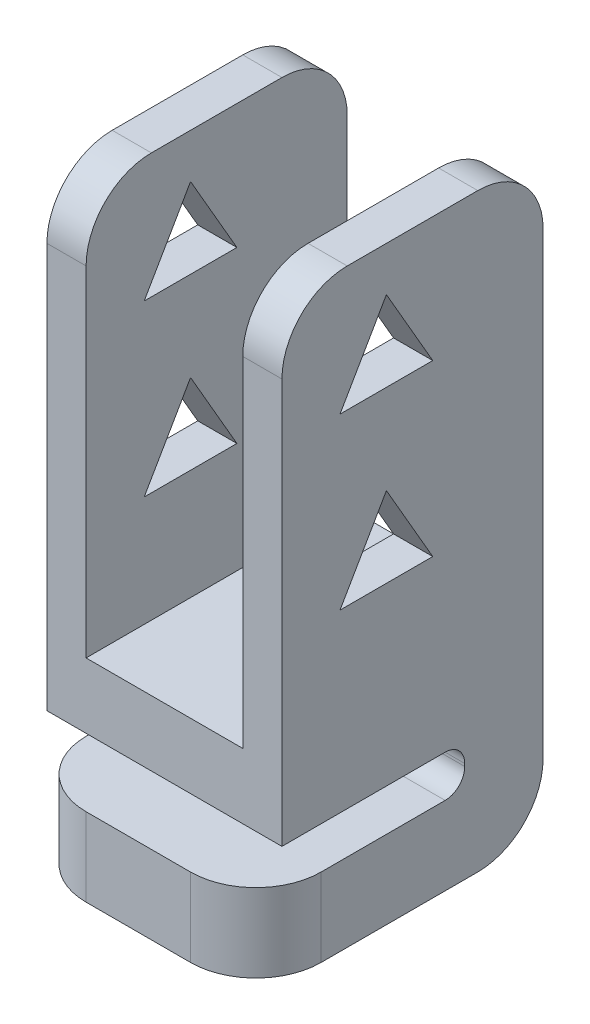
ISO-10303-21;
HEADER;
FILE_DESCRIPTION(('STEP AP214'),'2;1');
FILE_NAME('part.step','',(''),(''),'','','');
FILE_SCHEMA(('AUTOMOTIVE_DESIGN { 1 0 10303 214 1 1 1 1 }'));
ENDSEC;
DATA;
#1=APPLICATION_CONTEXT('core data for automotive mechanical design processes');
#2=APPLICATION_PROTOCOL_DEFINITION('international standard','automotive_design',2000,#1);
#3=PRODUCT_CONTEXT('',#1,'mechanical');
#4=PRODUCT('Part','Part','',(#3));
#5=PRODUCT_RELATED_PRODUCT_CATEGORY('part','',(#4));
#6=PRODUCT_DEFINITION_FORMATION('','',#4);
#7=PRODUCT_DEFINITION_CONTEXT('part definition',#1,'design');
#8=PRODUCT_DEFINITION('design','',#6,#7);
#9=PRODUCT_DEFINITION_SHAPE('','',#8);
#10=(LENGTH_UNIT() NAMED_UNIT(*) SI_UNIT(.MILLI.,.METRE.));
#11=(NAMED_UNIT(*) PLANE_ANGLE_UNIT() SI_UNIT($,.RADIAN.));
#12=(NAMED_UNIT(*) SI_UNIT($,.STERADIAN.) SOLID_ANGLE_UNIT());
#13=UNCERTAINTY_MEASURE_WITH_UNIT(LENGTH_MEASURE(1.E-05),#10,'distance_accuracy_value','');
#14=(GEOMETRIC_REPRESENTATION_CONTEXT(3) GLOBAL_UNCERTAINTY_ASSIGNED_CONTEXT((#13)) GLOBAL_UNIT_ASSIGNED_CONTEXT((#10,
#11,#12)) REPRESENTATION_CONTEXT('',''));
#15=CARTESIAN_POINT('',(0.,0.,0.));
#16=DIRECTION('',(0.,0.,1.));
#17=DIRECTION('',(1.,0.,0.));
#18=AXIS2_PLACEMENT_3D('',#15,#16,#17);
#19=CARTESIAN_POINT('',(4.5,9.,5.));
#20=DIRECTION('',(0.,-1.,0.));
#21=DIRECTION('',(0.,0.,-1.));
#22=AXIS2_PLACEMENT_3D('',#19,#20,#21);
#23=PLANE('',#22);
#24=DIRECTION('',(0.,0.,1.));
#25=VECTOR('',#24,1.);
#26=CARTESIAN_POINT('',(-4.5,9.,5.));
#27=LINE('',#26,#25);
#28=CARTESIAN_POINT('',(-4.5,9.,-2.5));
#29=VERTEX_POINT('',#28);
#30=CARTESIAN_POINT('',(-4.5,9.,2.5));
#31=VERTEX_POINT('',#30);
#32=EDGE_CURVE('E386',#29,#31,#27,.T.);
#33=ORIENTED_EDGE('',*,*,#32,.T.);
#34=DIRECTION('',(-1.,0.,0.));
#35=VECTOR('',#34,1.);
#36=CARTESIAN_POINT('',(4.5,9.,2.5));
#37=LINE('',#36,#35);
#38=CARTESIAN_POINT('',(-3.,9.,2.5));
#39=VERTEX_POINT('',#38);
#40=EDGE_CURVE('E466',#31,#39,#37,.F.);
#41=ORIENTED_EDGE('',*,*,#40,.T.);
#42=DIRECTION('',(0.,0.,1.));
#43=VECTOR('',#42,1.);
#44=CARTESIAN_POINT('',(-3.,9.,-21.6207701385947));
#45=LINE('',#44,#43);
#46=CARTESIAN_POINT('',(-3.,9.,-2.5));
#47=VERTEX_POINT('',#46);
#48=EDGE_CURVE('E357',#47,#39,#45,.T.);
#49=ORIENTED_EDGE('',*,*,#48,.F.);
#50=DIRECTION('',(-1.,0.,0.));
#51=VECTOR('',#50,1.);
#52=CARTESIAN_POINT('',(4.5,9.,-2.5));
#53=LINE('',#52,#51);
#54=EDGE_CURVE('E463',#47,#29,#53,.T.);
#55=ORIENTED_EDGE('',*,*,#54,.T.);
#56=EDGE_LOOP('',(#33,#41,#49,#55));
#57=FACE_BOUND('',#56,.T.);
#58=ADVANCED_FACE('F33',(#57),#23,.F.);
#59=CARTESIAN_POINT('',(4.5,9.,-5.));
#60=DIRECTION('',(0.,0.,1.));
#61=DIRECTION('',(0.,-1.,0.));
#62=AXIS2_PLACEMENT_3D('',#59,#60,#61);
#63=PLANE('',#62);
#64=DIRECTION('',(0.,1.,0.));
#65=VECTOR('',#64,1.);
#66=CARTESIAN_POINT('',(4.5,-13.6,-5.));
#67=LINE('',#66,#65);
#68=CARTESIAN_POINT('',(4.5,-11.1,-5.));
#69=VERTEX_POINT('',#68);
#70=CARTESIAN_POINT('',(4.5,6.5,-5.));
#71=VERTEX_POINT('',#70);
#72=EDGE_CURVE('E364',#69,#71,#67,.T.);
#73=ORIENTED_EDGE('',*,*,#72,.F.);
#74=DIRECTION('',(-1.,0.,0.));
#75=VECTOR('',#74,1.);
#76=CARTESIAN_POINT('',(4.5,-11.1,-5.));
#77=LINE('',#76,#75);
#78=CARTESIAN_POINT('',(-4.5,-11.1,-5.));
#79=VERTEX_POINT('',#78);
#80=EDGE_CURVE('E485',#69,#79,#77,.T.);
#81=ORIENTED_EDGE('',*,*,#80,.T.);
#82=DIRECTION('',(0.,1.,0.));
#83=VECTOR('',#82,1.);
#84=CARTESIAN_POINT('',(-4.5,9.,-5.));
#85=LINE('',#84,#83);
#86=CARTESIAN_POINT('',(-4.5,6.5,-5.));
#87=VERTEX_POINT('',#86);
#88=EDGE_CURVE('E363',#79,#87,#85,.T.);
#89=ORIENTED_EDGE('',*,*,#88,.T.);
#90=DIRECTION('',(-1.,0.,0.));
#91=VECTOR('',#90,1.);
#92=CARTESIAN_POINT('',(4.5,6.5,-5.));
#93=LINE('',#92,#91);
#94=CARTESIAN_POINT('',(-3.,6.5,-5.));
#95=VERTEX_POINT('',#94);
#96=EDGE_CURVE('E483',#87,#95,#93,.F.);
#97=ORIENTED_EDGE('',*,*,#96,.T.);
#98=DIRECTION('',(0.,1.,0.));
#99=VECTOR('',#98,1.);
#100=CARTESIAN_POINT('',(-3.,6.5,-5.));
#101=LINE('',#100,#99);
#102=CARTESIAN_POINT('',(-3.,-6.5,-5.));
#103=VERTEX_POINT('',#102);
#104=EDGE_CURVE('E338',#103,#95,#101,.T.);
#105=ORIENTED_EDGE('',*,*,#104,.F.);
#106=DIRECTION('',(-1.,0.,0.));
#107=VECTOR('',#106,1.);
#108=CARTESIAN_POINT('',(-3.,-6.5,-5.));
#109=LINE('',#108,#107);
#110=CARTESIAN_POINT('',(3.,-6.5,-5.));
#111=VERTEX_POINT('',#110);
#112=EDGE_CURVE('E341',#111,#103,#109,.T.);
#113=ORIENTED_EDGE('',*,*,#112,.F.);
#114=DIRECTION('',(0.,-1.,0.));
#115=VECTOR('',#114,1.);
#116=CARTESIAN_POINT('',(3.,9.,-5.));
#117=LINE('',#116,#115);
#118=CARTESIAN_POINT('',(3.,6.5,-5.));
#119=VERTEX_POINT('',#118);
#120=EDGE_CURVE('E344',#119,#111,#117,.T.);
#121=ORIENTED_EDGE('',*,*,#120,.F.);
#122=DIRECTION('',(-1.,0.,0.));
#123=VECTOR('',#122,1.);
#124=CARTESIAN_POINT('',(4.5,6.5,-5.));
#125=LINE('',#124,#123);
#126=EDGE_CURVE('E481',#119,#71,#125,.F.);
#127=ORIENTED_EDGE('',*,*,#126,.T.);
#128=EDGE_LOOP('',(#73,#81,#89,#97,#105,#113,#121,#127));
#129=FACE_BOUND('',#128,.T.);
#130=ADVANCED_FACE('F549',(#129),#63,.F.);
#131=DIRECTION('',(0.,0.,1.));
#132=VECTOR('',#131,1.);
#133=CARTESIAN_POINT('',(3.,9.,-21.6207701385947));
#134=LINE('',#133,#132);
#135=CARTESIAN_POINT('',(3.,9.,-2.5));
#136=VERTEX_POINT('',#135);
#137=CARTESIAN_POINT('',(3.,9.,2.5));
#138=VERTEX_POINT('',#137);
#139=EDGE_CURVE('E351',#136,#138,#134,.T.);
#140=ORIENTED_EDGE('',*,*,#139,.T.);
#141=DIRECTION('',(-1.,0.,0.));
#142=VECTOR('',#141,1.);
#143=CARTESIAN_POINT('',(4.5,9.,2.5));
#144=LINE('',#143,#142);
#145=CARTESIAN_POINT('',(4.5,9.,2.5));
#146=VERTEX_POINT('',#145);
#147=EDGE_CURVE('E479',#138,#146,#144,.F.);
#148=ORIENTED_EDGE('',*,*,#147,.T.);
#149=DIRECTION('',(0.,0.,1.));
#150=VECTOR('',#149,1.);
#151=CARTESIAN_POINT('',(4.5,9.,5.));
#152=LINE('',#151,#150);
#153=CARTESIAN_POINT('',(4.5,9.,-2.5));
#154=VERTEX_POINT('',#153);
#155=EDGE_CURVE('E367',#154,#146,#152,.T.);
#156=ORIENTED_EDGE('',*,*,#155,.F.);
#157=DIRECTION('',(-1.,0.,0.));
#158=VECTOR('',#157,1.);
#159=CARTESIAN_POINT('',(4.5,9.,-2.5));
#160=LINE('',#159,#158);
#161=EDGE_CURVE('E476',#154,#136,#160,.T.);
#162=ORIENTED_EDGE('',*,*,#161,.T.);
#163=EDGE_LOOP('',(#140,#148,#156,#162));
#164=FACE_BOUND('',#163,.T.);
#165=ADVANCED_FACE('F577',(#164),#23,.F.);
#166=CARTESIAN_POINT('',(4.5,9.,5.));
#167=DIRECTION('',(0.,0.,-1.));
#168=DIRECTION('',(0.,1.,0.));
#169=AXIS2_PLACEMENT_3D('',#166,#167,#168);
#170=PLANE('',#169);
#171=DIRECTION('',(0.,-1.,0.));
#172=VECTOR('',#171,1.);
#173=CARTESIAN_POINT('',(-3.,6.5,5.));
#174=LINE('',#173,#172);
#175=CARTESIAN_POINT('',(-3.,6.5,5.));
#176=VERTEX_POINT('',#175);
#177=CARTESIAN_POINT('',(-3.,-6.5,5.));
#178=VERTEX_POINT('',#177);
#179=EDGE_CURVE('E347',#176,#178,#174,.T.);
#180=ORIENTED_EDGE('',*,*,#179,.F.);
#181=DIRECTION('',(-1.,0.,0.));
#182=VECTOR('',#181,1.);
#183=CARTESIAN_POINT('',(4.5,6.5,5.));
#184=LINE('',#183,#182);
#185=CARTESIAN_POINT('',(-4.5,6.5,5.));
#186=VERTEX_POINT('',#185);
#187=EDGE_CURVE('E460',#176,#186,#184,.T.);
#188=ORIENTED_EDGE('',*,*,#187,.T.);
#189=DIRECTION('',(0.,-1.,0.));
#190=VECTOR('',#189,1.);
#191=CARTESIAN_POINT('',(-4.5,9.,5.));
#192=LINE('',#191,#190);
#193=CARTESIAN_POINT('',(-4.5,-9.,5.));
#194=VERTEX_POINT('',#193);
#195=EDGE_CURVE('E389',#186,#194,#192,.T.);
#196=ORIENTED_EDGE('',*,*,#195,.T.);
#197=DIRECTION('',(-1.,0.,0.));
#198=VECTOR('',#197,1.);
#199=CARTESIAN_POINT('',(4.5,-9.,5.));
#200=LINE('',#199,#198);
#201=CARTESIAN_POINT('',(4.5,-9.,5.));
#202=VERTEX_POINT('',#201);
#203=EDGE_CURVE('E405',#202,#194,#200,.T.);
#204=ORIENTED_EDGE('',*,*,#203,.F.);
#205=DIRECTION('',(0.,-1.,0.));
#206=VECTOR('',#205,1.);
#207=CARTESIAN_POINT('',(4.5,9.,5.));
#208=LINE('',#207,#206);
#209=CARTESIAN_POINT('',(4.5,6.5,5.));
#210=VERTEX_POINT('',#209);
#211=EDGE_CURVE('E371',#210,#202,#208,.T.);
#212=ORIENTED_EDGE('',*,*,#211,.F.);
#213=DIRECTION('',(-1.,0.,0.));
#214=VECTOR('',#213,1.);
#215=CARTESIAN_POINT('',(4.5,6.5,5.));
#216=LINE('',#215,#214);
#217=CARTESIAN_POINT('',(3.,6.5,5.));
#218=VERTEX_POINT('',#217);
#219=EDGE_CURVE('E457',#210,#218,#216,.T.);
#220=ORIENTED_EDGE('',*,*,#219,.T.);
#221=DIRECTION('',(0.,1.,0.));
#222=VECTOR('',#221,1.);
#223=CARTESIAN_POINT('',(3.,9.,5.));
#224=LINE('',#223,#222);
#225=CARTESIAN_POINT('',(3.,-6.5,5.));
#226=VERTEX_POINT('',#225);
#227=EDGE_CURVE('E337',#226,#218,#224,.T.);
#228=ORIENTED_EDGE('',*,*,#227,.F.);
#229=DIRECTION('',(1.,0.,0.));
#230=VECTOR('',#229,1.);
#231=CARTESIAN_POINT('',(-3.,-6.5,5.));
#232=LINE('',#231,#230);
#233=EDGE_CURVE('E349',#178,#226,#232,.T.);
#234=ORIENTED_EDGE('',*,*,#233,.F.);
#235=EDGE_LOOP('',(#180,#188,#196,#204,#212,#220,#228,#234));
#236=FACE_BOUND('',#235,.T.);
#237=ADVANCED_FACE('F528',(#236),#170,.F.);
#238=CARTESIAN_POINT('',(4.5,-9.,5.));
#239=DIRECTION('',(0.,1.,0.));
#240=DIRECTION('',(0.,0.,1.));
#241=AXIS2_PLACEMENT_3D('',#238,#239,#240);
#242=PLANE('',#241);
#243=DIRECTION('',(0.,0.,-1.));
#244=VECTOR('',#243,1.);
#245=CARTESIAN_POINT('',(-4.5,-9.,5.));
#246=LINE('',#245,#244);
#247=CARTESIAN_POINT('',(-4.5,-9.,-1.25));
#248=VERTEX_POINT('',#247);
#249=EDGE_CURVE('E391',#194,#248,#246,.T.);
#250=ORIENTED_EDGE('',*,*,#249,.T.);
#251=DIRECTION('',(-1.,0.,0.));
#252=VECTOR('',#251,1.);
#253=CARTESIAN_POINT('',(4.5,-9.,-1.25));
#254=LINE('',#253,#252);
#255=CARTESIAN_POINT('',(4.5,-9.,-1.25));
#256=VERTEX_POINT('',#255);
#257=EDGE_CURVE('E48',#248,#256,#254,.F.);
#258=ORIENTED_EDGE('',*,*,#257,.T.);
#259=DIRECTION('',(0.,0.,-1.));
#260=VECTOR('',#259,1.);
#261=CARTESIAN_POINT('',(4.5,-9.,5.));
#262=LINE('',#261,#260);
#263=EDGE_CURVE('E373',#202,#256,#262,.T.);
#264=ORIENTED_EDGE('',*,*,#263,.F.);
#265=ORIENTED_EDGE('',*,*,#203,.T.);
#266=EDGE_LOOP('',(#250,#258,#264,#265));
#267=FACE_BOUND('',#266,.T.);
#268=ADVANCED_FACE('F523',(#267),#242,.F.);
#269=CARTESIAN_POINT('',(4.5,-9.,-2.));
#270=DIRECTION('',(0.,0.,-1.));
#271=DIRECTION('',(0.,1.,0.));
#272=AXIS2_PLACEMENT_3D('',#269,#270,#271);
#273=PLANE('',#272);
#274=DIRECTION('',(0.,-1.,0.));
#275=VECTOR('',#274,1.);
#276=CARTESIAN_POINT('',(-4.5,-9.,-2.));
#277=LINE('',#276,#275);
#278=CARTESIAN_POINT('',(-4.5,-9.75,-2.));
#279=VERTEX_POINT('',#278);
#280=CARTESIAN_POINT('',(-4.5,-9.85,-2.));
#281=VERTEX_POINT('',#280);
#282=EDGE_CURVE('E393',#279,#281,#277,.T.);
#283=ORIENTED_EDGE('',*,*,#282,.T.);
#284=DIRECTION('',(-1.,0.,0.));
#285=VECTOR('',#284,1.);
#286=CARTESIAN_POINT('',(4.5,-9.85,-2.));
#287=LINE('',#286,#285);
#288=CARTESIAN_POINT('',(4.5,-9.85,-2.));
#289=VERTEX_POINT('',#288);
#290=EDGE_CURVE('E494',#281,#289,#287,.F.);
#291=ORIENTED_EDGE('',*,*,#290,.T.);
#292=DIRECTION('',(0.,-1.,0.));
#293=VECTOR('',#292,1.);
#294=CARTESIAN_POINT('',(4.5,-9.,-2.));
#295=LINE('',#294,#293);
#296=CARTESIAN_POINT('',(4.5,-9.75,-2.));
#297=VERTEX_POINT('',#296);
#298=EDGE_CURVE('E375',#297,#289,#295,.T.);
#299=ORIENTED_EDGE('',*,*,#298,.F.);
#300=DIRECTION('',(-1.,0.,0.));
#301=VECTOR('',#300,1.);
#302=CARTESIAN_POINT('',(-4.5,-9.75,-2.));
#303=LINE('',#302,#301);
#304=EDGE_CURVE('E491',#297,#279,#303,.T.);
#305=ORIENTED_EDGE('',*,*,#304,.T.);
#306=EDGE_LOOP('',(#283,#291,#299,#305));
#307=FACE_BOUND('',#306,.T.);
#308=ADVANCED_FACE('F517',(#307),#273,.F.);
#309=CARTESIAN_POINT('',(4.5,-10.6,-2.));
#310=DIRECTION('',(0.,-1.,0.));
#311=DIRECTION('',(0.,0.,-1.));
#312=AXIS2_PLACEMENT_3D('',#309,#310,#311);
#313=PLANE('',#312);
#314=DIRECTION('',(0.,0.,1.));
#315=VECTOR('',#314,1.);
#316=CARTESIAN_POINT('',(4.5,-10.6,-2.));
#317=LINE('',#316,#315);
#318=CARTESIAN_POINT('',(4.5,-10.6,-1.25));
#319=VERTEX_POINT('',#318);
#320=CARTESIAN_POINT('',(4.5,-10.6,3.5));
#321=VERTEX_POINT('',#320);
#322=EDGE_CURVE('E378',#319,#321,#317,.T.);
#323=ORIENTED_EDGE('',*,*,#322,.F.);
#324=DIRECTION('',(-1.,0.,0.));
#325=VECTOR('',#324,1.);
#326=CARTESIAN_POINT('',(-4.5,-10.6,-1.25));
#327=LINE('',#326,#325);
#328=CARTESIAN_POINT('',(-4.5,-10.6,-1.25));
#329=VERTEX_POINT('',#328);
#330=EDGE_CURVE('E488',#319,#329,#327,.T.);
#331=ORIENTED_EDGE('',*,*,#330,.T.);
#332=DIRECTION('',(0.,0.,1.));
#333=VECTOR('',#332,1.);
#334=CARTESIAN_POINT('',(-4.5,-10.6,-2.));
#335=LINE('',#334,#333);
#336=CARTESIAN_POINT('',(-4.5,-10.6,3.5));
#337=VERTEX_POINT('',#336);
#338=EDGE_CURVE('E396',#329,#337,#335,.T.);
#339=ORIENTED_EDGE('',*,*,#338,.T.);
#340=CARTESIAN_POINT('',(-2.,-10.6,3.5));
#341=DIRECTION('',(0.,-1.,0.));
#342=DIRECTION('',(0.,0.,-1.));
#343=AXIS2_PLACEMENT_3D('',#340,#341,#342);
#344=CIRCLE('',#343,2.5);
#345=CARTESIAN_POINT('',(-2.,-10.6,6.));
#346=VERTEX_POINT('',#345);
#347=EDGE_CURVE('E443',#337,#346,#344,.F.);
#348=ORIENTED_EDGE('',*,*,#347,.T.);
#349=DIRECTION('',(-1.,0.,0.));
#350=VECTOR('',#349,1.);
#351=CARTESIAN_POINT('',(4.5,-10.6,6.));
#352=LINE('',#351,#350);
#353=CARTESIAN_POINT('',(2.,-10.6,6.));
#354=VERTEX_POINT('',#353);
#355=EDGE_CURVE('E402',#354,#346,#352,.T.);
#356=ORIENTED_EDGE('',*,*,#355,.F.);
#357=CARTESIAN_POINT('',(2.,-10.6,3.5));
#358=DIRECTION('',(0.,-1.,0.));
#359=DIRECTION('',(0.,0.,-1.));
#360=AXIS2_PLACEMENT_3D('',#357,#358,#359);
#361=CIRCLE('',#360,2.5);
#362=EDGE_CURVE('E445',#354,#321,#361,.F.);
#363=ORIENTED_EDGE('',*,*,#362,.T.);
#364=EDGE_LOOP('',(#323,#331,#339,#348,#356,#363));
#365=FACE_BOUND('',#364,.T.);
#366=ADVANCED_FACE('F508',(#365),#313,.F.);
#367=CARTESIAN_POINT('',(4.5,-10.6,6.));
#368=DIRECTION('',(0.,0.,-1.));
#369=DIRECTION('',(0.,1.,0.));
#370=AXIS2_PLACEMENT_3D('',#367,#368,#369);
#371=PLANE('',#370);
#372=DIRECTION('',(-1.,0.,0.));
#373=VECTOR('',#372,1.);
#374=CARTESIAN_POINT('',(4.5,-13.6,6.));
#375=LINE('',#374,#373);
#376=CARTESIAN_POINT('',(2.,-13.6,6.));
#377=VERTEX_POINT('',#376);
#378=CARTESIAN_POINT('',(-2.,-13.6,6.));
#379=VERTEX_POINT('',#378);
#380=EDGE_CURVE('E383',#377,#379,#375,.T.);
#381=ORIENTED_EDGE('',*,*,#380,.F.);
#382=DIRECTION('',(0.,-1.,0.));
#383=VECTOR('',#382,1.);
#384=CARTESIAN_POINT('',(2.,-10.6,6.));
#385=LINE('',#384,#383);
#386=EDGE_CURVE('E441',#377,#354,#385,.F.);
#387=ORIENTED_EDGE('',*,*,#386,.T.);
#388=ORIENTED_EDGE('',*,*,#355,.T.);
#389=DIRECTION('',(0.,-1.,0.));
#390=VECTOR('',#389,1.);
#391=CARTESIAN_POINT('',(-2.,-13.6,6.));
#392=LINE('',#391,#390);
#393=EDGE_CURVE('E438',#346,#379,#392,.T.);
#394=ORIENTED_EDGE('',*,*,#393,.T.);
#395=EDGE_LOOP('',(#381,#387,#388,#394));
#396=FACE_BOUND('',#395,.T.);
#397=ADVANCED_FACE('F565',(#396),#371,.F.);
#398=CARTESIAN_POINT('',(4.5,-13.6,6.));
#399=DIRECTION('',(0.,1.,0.));
#400=DIRECTION('',(0.,0.,1.));
#401=AXIS2_PLACEMENT_3D('',#398,#399,#400);
#402=PLANE('',#401);
#403=DIRECTION('',(0.,0.,-1.));
#404=VECTOR('',#403,1.);
#405=CARTESIAN_POINT('',(4.5,-13.6,6.));
#406=LINE('',#405,#404);
#407=CARTESIAN_POINT('',(4.5,-13.6,3.5));
#408=VERTEX_POINT('',#407);
#409=CARTESIAN_POINT('',(4.5,-13.6,-2.5));
#410=VERTEX_POINT('',#409);
#411=EDGE_CURVE('E380',#408,#410,#406,.T.);
#412=ORIENTED_EDGE('',*,*,#411,.F.);
#413=CARTESIAN_POINT('',(2.,-13.6,3.5));
#414=DIRECTION('',(0.,1.,0.));
#415=DIRECTION('',(0.,0.,1.));
#416=AXIS2_PLACEMENT_3D('',#413,#414,#415);
#417=CIRCLE('',#416,2.5);
#418=EDGE_CURVE('E436',#408,#377,#417,.F.);
#419=ORIENTED_EDGE('',*,*,#418,.T.);
#420=ORIENTED_EDGE('',*,*,#380,.T.);
#421=CARTESIAN_POINT('',(-2.,-13.6,3.5));
#422=DIRECTION('',(0.,1.,0.));
#423=DIRECTION('',(0.,0.,1.));
#424=AXIS2_PLACEMENT_3D('',#421,#422,#423);
#425=CIRCLE('',#424,2.5);
#426=CARTESIAN_POINT('',(-4.5,-13.6,3.5));
#427=VERTEX_POINT('',#426);
#428=EDGE_CURVE('E434',#379,#427,#425,.F.);
#429=ORIENTED_EDGE('',*,*,#428,.T.);
#430=DIRECTION('',(0.,0.,-1.));
#431=VECTOR('',#430,1.);
#432=CARTESIAN_POINT('',(-4.5,-13.6,6.));
#433=LINE('',#432,#431);
#434=CARTESIAN_POINT('',(-4.5,-13.6,-2.5));
#435=VERTEX_POINT('',#434);
#436=EDGE_CURVE('E368',#427,#435,#433,.T.);
#437=ORIENTED_EDGE('',*,*,#436,.T.);
#438=DIRECTION('',(-1.,0.,0.));
#439=VECTOR('',#438,1.);
#440=CARTESIAN_POINT('',(4.5,-13.6,-2.5));
#441=LINE('',#440,#439);
#442=EDGE_CURVE('E432',#435,#410,#441,.F.);
#443=ORIENTED_EDGE('',*,*,#442,.T.);
#444=EDGE_LOOP('',(#412,#419,#420,#429,#437,#443));
#445=FACE_BOUND('',#444,.T.);
#446=ADVANCED_FACE('F558',(#445),#402,.F.);
#447=CARTESIAN_POINT('',(4.5,0.,0.));
#448=DIRECTION('',(-1.,0.,0.));
#449=DIRECTION('',(0.,0.,1.));
#450=AXIS2_PLACEMENT_3D('',#447,#448,#449);
#451=PLANE('',#450);
#452=DIRECTION('',(0.,0.866025403784439,0.5));
#453=VECTOR('',#452,1.);
#454=CARTESIAN_POINT('',(4.5,-2.275,-0.775352077758099));
#455=LINE('',#454,#453);
#456=CARTESIAN_POINT('',(4.5,-2.275,-0.775352077758099));
#457=VERTEX_POINT('',#456);
#458=CARTESIAN_POINT('',(4.5,0.8,0.999999999999999));
#459=VERTEX_POINT('',#458);
#460=EDGE_CURVE('E264',#457,#459,#455,.T.);
#461=ORIENTED_EDGE('',*,*,#460,.F.);
#462=DIRECTION('',(0.,0.,-1.));
#463=VECTOR('',#462,1.);
#464=CARTESIAN_POINT('',(4.5,-2.275,2.7753520777581));
#465=LINE('',#464,#463);
#466=CARTESIAN_POINT('',(4.5,-2.275,2.7753520777581));
#467=VERTEX_POINT('',#466);
#468=EDGE_CURVE('E269',#467,#457,#465,.T.);
#469=ORIENTED_EDGE('',*,*,#468,.F.);
#470=DIRECTION('',(0.,-0.866025403784439,0.5));
#471=VECTOR('',#470,1.);
#472=CARTESIAN_POINT('',(4.5,0.8,0.999999999999999));
#473=LINE('',#472,#471);
#474=EDGE_CURVE('E253',#459,#467,#473,.T.);
#475=ORIENTED_EDGE('',*,*,#474,.F.);
#476=EDGE_LOOP('',(#461,#469,#475));
#477=FACE_BOUND('',#476,.T.);
#478=DIRECTION('',(0.,0.866025403784439,0.5));
#479=VECTOR('',#478,1.);
#480=CARTESIAN_POINT('',(4.5,4.225,-0.775352077758099));
#481=LINE('',#480,#479);
#482=CARTESIAN_POINT('',(4.5,4.225,-0.775352077758099));
#483=VERTEX_POINT('',#482);
#484=CARTESIAN_POINT('',(4.5,7.3,1.));
#485=VERTEX_POINT('',#484);
#486=EDGE_CURVE('E302',#483,#485,#481,.T.);
#487=ORIENTED_EDGE('',*,*,#486,.F.);
#488=DIRECTION('',(0.,0.,-1.));
#489=VECTOR('',#488,1.);
#490=CARTESIAN_POINT('',(4.5,4.225,2.7753520777581));
#491=LINE('',#490,#489);
#492=CARTESIAN_POINT('',(4.5,4.225,2.7753520777581));
#493=VERTEX_POINT('',#492);
#494=EDGE_CURVE('E300',#493,#483,#491,.T.);
#495=ORIENTED_EDGE('',*,*,#494,.F.);
#496=DIRECTION('',(0.,-0.866025403784439,0.5));
#497=VECTOR('',#496,1.);
#498=CARTESIAN_POINT('',(4.5,7.3,1.));
#499=LINE('',#498,#497);
#500=EDGE_CURVE('E305',#485,#493,#499,.T.);
#501=ORIENTED_EDGE('',*,*,#500,.F.);
#502=EDGE_LOOP('',(#487,#495,#501));
#503=FACE_BOUND('',#502,.T.);
#504=ORIENTED_EDGE('',*,*,#298,.T.);
#505=CARTESIAN_POINT('',(4.5,-9.85,-1.25));
#506=DIRECTION('',(-1.,0.,0.));
#507=DIRECTION('',(0.,0.,1.));
#508=AXIS2_PLACEMENT_3D('',#505,#506,#507);
#509=CIRCLE('',#508,0.75);
#510=EDGE_CURVE('E499',#289,#319,#509,.T.);
#511=ORIENTED_EDGE('',*,*,#510,.T.);
#512=ORIENTED_EDGE('',*,*,#322,.T.);
#513=DIRECTION('',(0.,-1.,0.));
#514=VECTOR('',#513,1.);
#515=CARTESIAN_POINT('',(4.5,0.,3.5));
#516=LINE('',#515,#514);
#517=EDGE_CURVE('E429',#321,#408,#516,.T.);
#518=ORIENTED_EDGE('',*,*,#517,.T.);
#519=ORIENTED_EDGE('',*,*,#411,.T.);
#520=CARTESIAN_POINT('',(4.5,-11.1,-2.5));
#521=DIRECTION('',(-1.,0.,0.));
#522=DIRECTION('',(0.,0.,1.));
#523=AXIS2_PLACEMENT_3D('',#520,#521,#522);
#524=CIRCLE('',#523,2.5);
#525=EDGE_CURVE('E425',#410,#69,#524,.F.);
#526=ORIENTED_EDGE('',*,*,#525,.T.);
#527=ORIENTED_EDGE('',*,*,#72,.T.);
#528=CARTESIAN_POINT('',(4.5,6.5,-2.5));
#529=DIRECTION('',(-1.,0.,0.));
#530=DIRECTION('',(0.,0.,1.));
#531=AXIS2_PLACEMENT_3D('',#528,#529,#530);
#532=CIRCLE('',#531,2.5);
#533=EDGE_CURVE('E423',#71,#154,#532,.F.);
#534=ORIENTED_EDGE('',*,*,#533,.T.);
#535=ORIENTED_EDGE('',*,*,#155,.T.);
#536=CARTESIAN_POINT('',(4.5,6.5,2.5));
#537=DIRECTION('',(-1.,0.,0.));
#538=DIRECTION('',(0.,0.,1.));
#539=AXIS2_PLACEMENT_3D('',#536,#537,#538);
#540=CIRCLE('',#539,2.5);
#541=EDGE_CURVE('E427',#146,#210,#540,.F.);
#542=ORIENTED_EDGE('',*,*,#541,.T.);
#543=ORIENTED_EDGE('',*,*,#211,.T.);
#544=ORIENTED_EDGE('',*,*,#263,.T.);
#545=CARTESIAN_POINT('',(4.5,-9.75,-1.25));
#546=DIRECTION('',(-1.,0.,0.));
#547=DIRECTION('',(0.,0.,1.));
#548=AXIS2_PLACEMENT_3D('',#545,#546,#547);
#549=CIRCLE('',#548,0.75);
#550=EDGE_CURVE('E11',#256,#297,#549,.T.);
#551=ORIENTED_EDGE('',*,*,#550,.T.);
#552=EDGE_LOOP('',(#504,#511,#512,#518,#519,#526,#527,#534,#535,#542,#543,#544,#551));
#553=FACE_BOUND('',#552,.T.);
#554=ADVANCED_FACE('F271',(#477,#503,#553),#451,.F.);
#555=CARTESIAN_POINT('',(-4.5,0.,0.));
#556=DIRECTION('',(-1.,0.,0.));
#557=DIRECTION('',(0.,0.,1.));
#558=AXIS2_PLACEMENT_3D('',#555,#556,#557);
#559=PLANE('',#558);
#560=DIRECTION('',(0.,0.,-1.));
#561=VECTOR('',#560,1.);
#562=CARTESIAN_POINT('',(-4.5,-2.275,2.7753520777581));
#563=LINE('',#562,#561);
#564=CARTESIAN_POINT('',(-4.5,-2.275,2.7753520777581));
#565=VERTEX_POINT('',#564);
#566=CARTESIAN_POINT('',(-4.5,-2.275,-0.775352077758099));
#567=VERTEX_POINT('',#566);
#568=EDGE_CURVE('E273',#565,#567,#563,.T.);
#569=ORIENTED_EDGE('',*,*,#568,.T.);
#570=DIRECTION('',(0.,0.866025403784439,0.5));
#571=VECTOR('',#570,1.);
#572=CARTESIAN_POINT('',(-4.5,-2.275,-0.775352077758099));
#573=LINE('',#572,#571);
#574=CARTESIAN_POINT('',(-4.5,0.8,1.));
#575=VERTEX_POINT('',#574);
#576=EDGE_CURVE('E276',#567,#575,#573,.T.);
#577=ORIENTED_EDGE('',*,*,#576,.T.);
#578=DIRECTION('',(0.,-0.866025403784439,0.5));
#579=VECTOR('',#578,1.);
#580=CARTESIAN_POINT('',(-4.5,0.8,0.999999999999999));
#581=LINE('',#580,#579);
#582=EDGE_CURVE('E282',#575,#565,#581,.T.);
#583=ORIENTED_EDGE('',*,*,#582,.T.);
#584=EDGE_LOOP('',(#569,#577,#583));
#585=FACE_BOUND('',#584,.T.);
#586=DIRECTION('',(0.,0.,-1.));
#587=VECTOR('',#586,1.);
#588=CARTESIAN_POINT('',(-4.5,4.225,2.7753520777581));
#589=LINE('',#588,#587);
#590=CARTESIAN_POINT('',(-4.5,4.225,2.7753520777581));
#591=VERTEX_POINT('',#590);
#592=CARTESIAN_POINT('',(-4.5,4.225,-0.775352077758099));
#593=VERTEX_POINT('',#592);
#594=EDGE_CURVE('E308',#591,#593,#589,.T.);
#595=ORIENTED_EDGE('',*,*,#594,.T.);
#596=DIRECTION('',(0.,0.866025403784439,0.5));
#597=VECTOR('',#596,1.);
#598=CARTESIAN_POINT('',(-4.5,4.225,-0.775352077758099));
#599=LINE('',#598,#597);
#600=CARTESIAN_POINT('',(-4.5,7.3,0.999999999999999));
#601=VERTEX_POINT('',#600);
#602=EDGE_CURVE('E311',#593,#601,#599,.T.);
#603=ORIENTED_EDGE('',*,*,#602,.T.);
#604=DIRECTION('',(0.,-0.866025403784439,0.5));
#605=VECTOR('',#604,1.);
#606=CARTESIAN_POINT('',(-4.5,7.3,1.));
#607=LINE('',#606,#605);
#608=EDGE_CURVE('E314',#601,#591,#607,.T.);
#609=ORIENTED_EDGE('',*,*,#608,.T.);
#610=EDGE_LOOP('',(#595,#603,#609));
#611=FACE_BOUND('',#610,.T.);
#612=ORIENTED_EDGE('',*,*,#436,.F.);
#613=DIRECTION('',(0.,-1.,0.));
#614=VECTOR('',#613,1.);
#615=CARTESIAN_POINT('',(-4.5,-10.6,3.5));
#616=LINE('',#615,#614);
#617=EDGE_CURVE('E454',#427,#337,#616,.F.);
#618=ORIENTED_EDGE('',*,*,#617,.T.);
#619=ORIENTED_EDGE('',*,*,#338,.F.);
#620=CARTESIAN_POINT('',(-4.5,-9.85,-1.25));
#621=DIRECTION('',(-1.,0.,0.));
#622=DIRECTION('',(0.,0.,1.));
#623=AXIS2_PLACEMENT_3D('',#620,#621,#622);
#624=CIRCLE('',#623,0.75);
#625=EDGE_CURVE('E497',#329,#281,#624,.F.);
#626=ORIENTED_EDGE('',*,*,#625,.T.);
#627=ORIENTED_EDGE('',*,*,#282,.F.);
#628=CARTESIAN_POINT('',(-4.5,-9.75,-1.25));
#629=DIRECTION('',(-1.,0.,0.));
#630=DIRECTION('',(0.,0.,1.));
#631=AXIS2_PLACEMENT_3D('',#628,#629,#630);
#632=CIRCLE('',#631,0.75);
#633=EDGE_CURVE('E41',#279,#248,#632,.F.);
#634=ORIENTED_EDGE('',*,*,#633,.T.);
#635=ORIENTED_EDGE('',*,*,#249,.F.);
#636=ORIENTED_EDGE('',*,*,#195,.F.);
#637=CARTESIAN_POINT('',(-4.5,6.5,2.5));
#638=DIRECTION('',(-1.,0.,0.));
#639=DIRECTION('',(0.,0.,1.));
#640=AXIS2_PLACEMENT_3D('',#637,#638,#639);
#641=CIRCLE('',#640,2.5);
#642=EDGE_CURVE('E452',#186,#31,#641,.T.);
#643=ORIENTED_EDGE('',*,*,#642,.T.);
#644=ORIENTED_EDGE('',*,*,#32,.F.);
#645=CARTESIAN_POINT('',(-4.5,6.5,-2.5));
#646=DIRECTION('',(-1.,0.,0.));
#647=DIRECTION('',(0.,0.,1.));
#648=AXIS2_PLACEMENT_3D('',#645,#646,#647);
#649=CIRCLE('',#648,2.5);
#650=EDGE_CURVE('E448',#29,#87,#649,.T.);
#651=ORIENTED_EDGE('',*,*,#650,.T.);
#652=ORIENTED_EDGE('',*,*,#88,.F.);
#653=CARTESIAN_POINT('',(-4.5,-11.1,-2.5));
#654=DIRECTION('',(-1.,0.,0.));
#655=DIRECTION('',(0.,0.,1.));
#656=AXIS2_PLACEMENT_3D('',#653,#654,#655);
#657=CIRCLE('',#656,2.5);
#658=EDGE_CURVE('E450',#79,#435,#657,.T.);
#659=ORIENTED_EDGE('',*,*,#658,.T.);
#660=EDGE_LOOP('',(#612,#618,#619,#626,#627,#634,#635,#636,#643,#644,#651,#652,#659));
#661=FACE_BOUND('',#660,.T.);
#662=ADVANCED_FACE('F515',(#585,#611,#661),#559,.T.);
#663=CARTESIAN_POINT('',(-3.,-6.5,-21.6207701385947));
#664=DIRECTION('',(0.,-1.,0.));
#665=DIRECTION('',(0.,0.,-1.));
#666=AXIS2_PLACEMENT_3D('',#663,#664,#665);
#667=PLANE('',#666);
#668=ORIENTED_EDGE('',*,*,#112,.T.);
#669=DIRECTION('',(0.,0.,1.));
#670=VECTOR('',#669,1.);
#671=CARTESIAN_POINT('',(-3.,-6.5,-21.6207701385947));
#672=LINE('',#671,#670);
#673=EDGE_CURVE('E354',#103,#178,#672,.T.);
#674=ORIENTED_EDGE('',*,*,#673,.T.);
#675=ORIENTED_EDGE('',*,*,#233,.T.);
#676=DIRECTION('',(0.,0.,1.));
#677=VECTOR('',#676,1.);
#678=CARTESIAN_POINT('',(3.,-6.5,-21.6207701385947));
#679=LINE('',#678,#677);
#680=EDGE_CURVE('E342',#111,#226,#679,.T.);
#681=ORIENTED_EDGE('',*,*,#680,.F.);
#682=EDGE_LOOP('',(#668,#674,#675,#681));
#683=FACE_BOUND('',#682,.T.);
#684=ADVANCED_FACE('F589',(#683),#667,.F.);
#685=CARTESIAN_POINT('',(-3.,6.5,-21.6207701385947));
#686=DIRECTION('',(-1.,0.,0.));
#687=DIRECTION('',(0.,-1.,0.));
#688=AXIS2_PLACEMENT_3D('',#685,#686,#687);
#689=PLANE('',#688);
#690=DIRECTION('',(0.,-0.866025403784439,-0.5));
#691=VECTOR('',#690,1.);
#692=CARTESIAN_POINT('',(-3.,-4.72008079659571,-2.18702013386302));
#693=LINE('',#692,#691);
#694=CARTESIAN_POINT('',(-3.,0.8,0.999999999999999));
#695=VERTEX_POINT('',#694);
#696=CARTESIAN_POINT('',(-3.,-2.275,-0.775352077758101));
#697=VERTEX_POINT('',#696);
#698=EDGE_CURVE('E287',#695,#697,#693,.T.);
#699=ORIENTED_EDGE('',*,*,#698,.T.);
#700=DIRECTION('',(0.,0.,1.));
#701=VECTOR('',#700,1.);
#702=CARTESIAN_POINT('',(-3.,-2.275,-21.6207701385947));
#703=LINE('',#702,#701);
#704=CARTESIAN_POINT('',(-3.,-2.275,2.7753520777581));
#705=VERTEX_POINT('',#704);
#706=EDGE_CURVE('E297',#697,#705,#703,.T.);
#707=ORIENTED_EDGE('',*,*,#706,.T.);
#708=DIRECTION('',(0.,0.866025403784439,-0.5));
#709=VECTOR('',#708,1.);
#710=CARTESIAN_POINT('',(-3.,14.8700807965957,-7.12336493543431));
#711=LINE('',#710,#709);
#712=EDGE_CURVE('E294',#705,#695,#711,.T.);
#713=ORIENTED_EDGE('',*,*,#712,.T.);
#714=EDGE_LOOP('',(#699,#707,#713));
#715=FACE_BOUND('',#714,.T.);
#716=DIRECTION('',(0.,-0.866025403784439,-0.5));
#717=VECTOR('',#716,1.);
#718=CARTESIAN_POINT('',(-3.,-3.09508079659571,-5.00160269616244));
#719=LINE('',#718,#717);
#720=CARTESIAN_POINT('',(-3.,7.3,1.));
#721=VERTEX_POINT('',#720);
#722=CARTESIAN_POINT('',(-3.,4.225,-0.775352077758099));
#723=VERTEX_POINT('',#722);
#724=EDGE_CURVE('E321',#721,#723,#719,.T.);
#725=ORIENTED_EDGE('',*,*,#724,.T.);
#726=DIRECTION('',(0.,0.,1.));
#727=VECTOR('',#726,1.);
#728=CARTESIAN_POINT('',(-3.,4.225,-21.6207701385947));
#729=LINE('',#728,#727);
#730=CARTESIAN_POINT('',(-3.,4.225,2.7753520777581));
#731=VERTEX_POINT('',#730);
#732=EDGE_CURVE('E334',#723,#731,#729,.T.);
#733=ORIENTED_EDGE('',*,*,#732,.T.);
#734=DIRECTION('',(0.,0.866025403784439,-0.5));
#735=VECTOR('',#734,1.);
#736=CARTESIAN_POINT('',(-3.,16.4950807965957,-4.30878237313488));
#737=LINE('',#736,#735);
#738=EDGE_CURVE('E331',#731,#721,#737,.T.);
#739=ORIENTED_EDGE('',*,*,#738,.T.);
#740=EDGE_LOOP('',(#725,#733,#739));
#741=FACE_BOUND('',#740,.T.);
#742=ORIENTED_EDGE('',*,*,#48,.T.);
#743=CARTESIAN_POINT('',(-3.,6.5,2.5));
#744=DIRECTION('',(-1.,0.,0.));
#745=DIRECTION('',(0.,-1.,0.));
#746=AXIS2_PLACEMENT_3D('',#743,#744,#745);
#747=CIRCLE('',#746,2.5);
#748=EDGE_CURVE('E470',#39,#176,#747,.F.);
#749=ORIENTED_EDGE('',*,*,#748,.T.);
#750=ORIENTED_EDGE('',*,*,#179,.T.);
#751=ORIENTED_EDGE('',*,*,#673,.F.);
#752=ORIENTED_EDGE('',*,*,#104,.T.);
#753=CARTESIAN_POINT('',(-3.,6.5,-2.5));
#754=DIRECTION('',(-1.,0.,0.));
#755=DIRECTION('',(0.,-1.,0.));
#756=AXIS2_PLACEMENT_3D('',#753,#754,#755);
#757=CIRCLE('',#756,2.5);
#758=EDGE_CURVE('E468',#95,#47,#757,.F.);
#759=ORIENTED_EDGE('',*,*,#758,.T.);
#760=EDGE_LOOP('',(#742,#749,#750,#751,#752,#759));
#761=FACE_BOUND('',#760,.T.);
#762=ADVANCED_FACE('F539',(#715,#741,#761),#689,.F.);
#763=CARTESIAN_POINT('',(3.,9.,-21.6207701385947));
#764=DIRECTION('',(1.,0.,0.));
#765=DIRECTION('',(0.,0.,-1.));
#766=AXIS2_PLACEMENT_3D('',#763,#764,#765);
#767=PLANE('',#766);
#768=DIRECTION('',(0.,-0.866025403784439,0.5));
#769=VECTOR('',#768,1.);
#770=CARTESIAN_POINT('',(3.,16.7450807965957,-8.20589669016486));
#771=LINE('',#770,#769);
#772=CARTESIAN_POINT('',(3.,0.799999999999999,0.999999999999998));
#773=VERTEX_POINT('',#772);
#774=CARTESIAN_POINT('',(3.,-2.275,2.7753520777581));
#775=VERTEX_POINT('',#774);
#776=EDGE_CURVE('E256',#773,#775,#771,.T.);
#777=ORIENTED_EDGE('',*,*,#776,.T.);
#778=DIRECTION('',(0.,0.,-1.));
#779=VECTOR('',#778,1.);
#780=CARTESIAN_POINT('',(3.,-2.275,-21.6207701385947));
#781=LINE('',#780,#779);
#782=CARTESIAN_POINT('',(3.,-2.275,-0.775352077758099));
#783=VERTEX_POINT('',#782);
#784=EDGE_CURVE('E420',#775,#783,#781,.T.);
#785=ORIENTED_EDGE('',*,*,#784,.T.);
#786=DIRECTION('',(0.,0.866025403784439,0.5));
#787=VECTOR('',#786,1.);
#788=CARTESIAN_POINT('',(3.,-2.8450807965957,-1.10448837913247));
#789=LINE('',#788,#787);
#790=EDGE_CURVE('E417',#783,#773,#789,.T.);
#791=ORIENTED_EDGE('',*,*,#790,.T.);
#792=EDGE_LOOP('',(#777,#785,#791));
#793=FACE_BOUND('',#792,.T.);
#794=DIRECTION('',(0.,-0.866025403784439,0.5));
#795=VECTOR('',#794,1.);
#796=CARTESIAN_POINT('',(3.,18.3700807965957,-5.39131412786543));
#797=LINE('',#796,#795);
#798=CARTESIAN_POINT('',(3.,7.3,0.999999999999999));
#799=VERTEX_POINT('',#798);
#800=CARTESIAN_POINT('',(3.,4.225,2.7753520777581));
#801=VERTEX_POINT('',#800);
#802=EDGE_CURVE('E411',#799,#801,#797,.T.);
#803=ORIENTED_EDGE('',*,*,#802,.T.);
#804=DIRECTION('',(0.,0.,-1.));
#805=VECTOR('',#804,1.);
#806=CARTESIAN_POINT('',(3.,4.225,-21.6207701385947));
#807=LINE('',#806,#805);
#808=CARTESIAN_POINT('',(3.,4.225,-0.775352077758099));
#809=VERTEX_POINT('',#808);
#810=EDGE_CURVE('E414',#801,#809,#807,.T.);
#811=ORIENTED_EDGE('',*,*,#810,.T.);
#812=DIRECTION('',(0.,0.866025403784439,0.5));
#813=VECTOR('',#812,1.);
#814=CARTESIAN_POINT('',(3.,-1.2200807965957,-3.91907094143189));
#815=LINE('',#814,#813);
#816=EDGE_CURVE('E408',#809,#799,#815,.T.);
#817=ORIENTED_EDGE('',*,*,#816,.T.);
#818=EDGE_LOOP('',(#803,#811,#817));
#819=FACE_BOUND('',#818,.T.);
#820=ORIENTED_EDGE('',*,*,#227,.T.);
#821=CARTESIAN_POINT('',(3.,6.5,2.5));
#822=DIRECTION('',(1.,0.,0.));
#823=DIRECTION('',(0.,0.,-1.));
#824=AXIS2_PLACEMENT_3D('',#821,#822,#823);
#825=CIRCLE('',#824,2.5);
#826=EDGE_CURVE('E474',#218,#138,#825,.F.);
#827=ORIENTED_EDGE('',*,*,#826,.T.);
#828=ORIENTED_EDGE('',*,*,#139,.F.);
#829=CARTESIAN_POINT('',(3.,6.5,-2.5));
#830=DIRECTION('',(1.,0.,0.));
#831=DIRECTION('',(0.,0.,-1.));
#832=AXIS2_PLACEMENT_3D('',#829,#830,#831);
#833=CIRCLE('',#832,2.5);
#834=EDGE_CURVE('E472',#136,#119,#833,.F.);
#835=ORIENTED_EDGE('',*,*,#834,.T.);
#836=ORIENTED_EDGE('',*,*,#120,.T.);
#837=ORIENTED_EDGE('',*,*,#680,.T.);
#838=EDGE_LOOP('',(#820,#827,#828,#835,#836,#837));
#839=FACE_BOUND('',#838,.T.);
#840=ADVANCED_FACE('F580',(#793,#819,#839),#767,.F.);
#841=CARTESIAN_POINT('',(-4.5,4.225,-0.775352077758099));
#842=DIRECTION('',(0.,0.5,-0.866025403784439));
#843=DIRECTION('',(0.,0.866025403784439,0.5));
#844=AXIS2_PLACEMENT_3D('',#841,#842,#843);
#845=PLANE('',#844);
#846=DIRECTION('',(1.,0.,0.));
#847=VECTOR('',#846,1.);
#848=CARTESIAN_POINT('',(-4.5,4.225,-0.775352077758099));
#849=LINE('',#848,#847);
#850=EDGE_CURVE('E317',#809,#483,#849,.T.);
#851=ORIENTED_EDGE('',*,*,#850,.T.);
#852=ORIENTED_EDGE('',*,*,#486,.T.);
#853=DIRECTION('',(1.,0.,0.));
#854=VECTOR('',#853,1.);
#855=CARTESIAN_POINT('',(-4.5,7.3,1.));
#856=LINE('',#855,#854);
#857=EDGE_CURVE('E326',#799,#485,#856,.T.);
#858=ORIENTED_EDGE('',*,*,#857,.F.);
#859=ORIENTED_EDGE('',*,*,#816,.F.);
#860=EDGE_LOOP('',(#851,#852,#858,#859));
#861=FACE_BOUND('',#860,.T.);
#862=ADVANCED_FACE('F629',(#861),#845,.F.);
#863=CARTESIAN_POINT('',(-4.5,7.3,1.));
#864=DIRECTION('',(0.,0.5,0.866025403784439));
#865=DIRECTION('',(0.,-0.866025403784439,0.5));
#866=AXIS2_PLACEMENT_3D('',#863,#864,#865);
#867=PLANE('',#866);
#868=ORIENTED_EDGE('',*,*,#857,.T.);
#869=ORIENTED_EDGE('',*,*,#500,.T.);
#870=DIRECTION('',(1.,0.,0.));
#871=VECTOR('',#870,1.);
#872=CARTESIAN_POINT('',(-4.5,4.225,2.7753520777581));
#873=LINE('',#872,#871);
#874=EDGE_CURVE('E322',#801,#493,#873,.T.);
#875=ORIENTED_EDGE('',*,*,#874,.F.);
#876=ORIENTED_EDGE('',*,*,#802,.F.);
#877=EDGE_LOOP('',(#868,#869,#875,#876));
#878=FACE_BOUND('',#877,.T.);
#879=ADVANCED_FACE('F634',(#878),#867,.F.);
#880=CARTESIAN_POINT('',(-4.5,4.225,2.7753520777581));
#881=DIRECTION('',(0.,-1.,0.));
#882=DIRECTION('',(0.,0.,-1.));
#883=AXIS2_PLACEMENT_3D('',#880,#881,#882);
#884=PLANE('',#883);
#885=ORIENTED_EDGE('',*,*,#874,.T.);
#886=ORIENTED_EDGE('',*,*,#494,.T.);
#887=ORIENTED_EDGE('',*,*,#850,.F.);
#888=ORIENTED_EDGE('',*,*,#810,.F.);
#889=EDGE_LOOP('',(#885,#886,#887,#888));
#890=FACE_BOUND('',#889,.T.);
#891=ADVANCED_FACE('F645',(#890),#884,.F.);
#892=EDGE_CURVE('E327',#593,#723,#849,.T.);
#893=ORIENTED_EDGE('',*,*,#892,.F.);
#894=ORIENTED_EDGE('',*,*,#594,.F.);
#895=EDGE_CURVE('E318',#591,#731,#873,.T.);
#896=ORIENTED_EDGE('',*,*,#895,.T.);
#897=ORIENTED_EDGE('',*,*,#732,.F.);
#898=EDGE_LOOP('',(#893,#894,#896,#897));
#899=FACE_BOUND('',#898,.T.);
#900=ADVANCED_FACE('F650',(#899),#884,.F.);
#901=ORIENTED_EDGE('',*,*,#895,.F.);
#902=ORIENTED_EDGE('',*,*,#608,.F.);
#903=EDGE_CURVE('E323',#601,#721,#856,.T.);
#904=ORIENTED_EDGE('',*,*,#903,.T.);
#905=ORIENTED_EDGE('',*,*,#738,.F.);
#906=EDGE_LOOP('',(#901,#902,#904,#905));
#907=FACE_BOUND('',#906,.T.);
#908=ADVANCED_FACE('F655',(#907),#867,.F.);
#909=ORIENTED_EDGE('',*,*,#903,.F.);
#910=ORIENTED_EDGE('',*,*,#602,.F.);
#911=ORIENTED_EDGE('',*,*,#892,.T.);
#912=ORIENTED_EDGE('',*,*,#724,.F.);
#913=EDGE_LOOP('',(#909,#910,#911,#912));
#914=FACE_BOUND('',#913,.T.);
#915=ADVANCED_FACE('F637',(#914),#845,.F.);
#916=CARTESIAN_POINT('',(-4.5,-2.275,-0.775352077758099));
#917=DIRECTION('',(0.,0.5,-0.866025403784439));
#918=DIRECTION('',(0.,0.866025403784439,0.5));
#919=AXIS2_PLACEMENT_3D('',#916,#917,#918);
#920=PLANE('',#919);
#921=DIRECTION('',(1.,0.,0.));
#922=VECTOR('',#921,1.);
#923=CARTESIAN_POINT('',(-4.5,-2.275,-0.775352077758099));
#924=LINE('',#923,#922);
#925=EDGE_CURVE('E267',#783,#457,#924,.T.);
#926=ORIENTED_EDGE('',*,*,#925,.T.);
#927=ORIENTED_EDGE('',*,*,#460,.T.);
#928=DIRECTION('',(1.,0.,0.));
#929=VECTOR('',#928,1.);
#930=CARTESIAN_POINT('',(-4.5,0.8,0.999999999999999));
#931=LINE('',#930,#929);
#932=EDGE_CURVE('E248',#773,#459,#931,.T.);
#933=ORIENTED_EDGE('',*,*,#932,.F.);
#934=ORIENTED_EDGE('',*,*,#790,.F.);
#935=EDGE_LOOP('',(#926,#927,#933,#934));
#936=FACE_BOUND('',#935,.T.);
#937=ADVANCED_FACE('F265',(#936),#920,.F.);
#938=CARTESIAN_POINT('',(-4.5,0.8,0.999999999999999));
#939=DIRECTION('',(0.,0.5,0.866025403784439));
#940=DIRECTION('',(0.,-0.866025403784439,0.5));
#941=AXIS2_PLACEMENT_3D('',#938,#939,#940);
#942=PLANE('',#941);
#943=ORIENTED_EDGE('',*,*,#932,.T.);
#944=ORIENTED_EDGE('',*,*,#474,.T.);
#945=DIRECTION('',(1.,0.,0.));
#946=VECTOR('',#945,1.);
#947=CARTESIAN_POINT('',(-4.5,-2.275,2.7753520777581));
#948=LINE('',#947,#946);
#949=EDGE_CURVE('E288',#775,#467,#948,.T.);
#950=ORIENTED_EDGE('',*,*,#949,.F.);
#951=ORIENTED_EDGE('',*,*,#776,.F.);
#952=EDGE_LOOP('',(#943,#944,#950,#951));
#953=FACE_BOUND('',#952,.T.);
#954=ADVANCED_FACE('F250',(#953),#942,.F.);
#955=CARTESIAN_POINT('',(-4.5,-2.275,2.7753520777581));
#956=DIRECTION('',(0.,-1.,0.));
#957=DIRECTION('',(0.,0.,-1.));
#958=AXIS2_PLACEMENT_3D('',#955,#956,#957);
#959=PLANE('',#958);
#960=ORIENTED_EDGE('',*,*,#949,.T.);
#961=ORIENTED_EDGE('',*,*,#468,.T.);
#962=ORIENTED_EDGE('',*,*,#925,.F.);
#963=ORIENTED_EDGE('',*,*,#784,.F.);
#964=EDGE_LOOP('',(#960,#961,#962,#963));
#965=FACE_BOUND('',#964,.T.);
#966=ADVANCED_FACE('F667',(#965),#959,.F.);
#967=EDGE_CURVE('E260',#567,#697,#924,.T.);
#968=ORIENTED_EDGE('',*,*,#967,.F.);
#969=ORIENTED_EDGE('',*,*,#568,.F.);
#970=EDGE_CURVE('E285',#565,#705,#948,.T.);
#971=ORIENTED_EDGE('',*,*,#970,.T.);
#972=ORIENTED_EDGE('',*,*,#706,.F.);
#973=EDGE_LOOP('',(#968,#969,#971,#972));
#974=FACE_BOUND('',#973,.T.);
#975=ADVANCED_FACE('F663',(#974),#959,.F.);
#976=ORIENTED_EDGE('',*,*,#970,.F.);
#977=ORIENTED_EDGE('',*,*,#582,.F.);
#978=EDGE_CURVE('E259',#575,#695,#931,.T.);
#979=ORIENTED_EDGE('',*,*,#978,.T.);
#980=ORIENTED_EDGE('',*,*,#712,.F.);
#981=EDGE_LOOP('',(#976,#977,#979,#980));
#982=FACE_BOUND('',#981,.T.);
#983=ADVANCED_FACE('F666',(#982),#942,.F.);
#984=ORIENTED_EDGE('',*,*,#978,.F.);
#985=ORIENTED_EDGE('',*,*,#576,.F.);
#986=ORIENTED_EDGE('',*,*,#967,.T.);
#987=ORIENTED_EDGE('',*,*,#698,.F.);
#988=EDGE_LOOP('',(#984,#985,#986,#987));
#989=FACE_BOUND('',#988,.T.);
#990=ADVANCED_FACE('F669',(#989),#920,.F.);
#991=CARTESIAN_POINT('',(2.,0.,3.5));
#992=DIRECTION('',(0.,-1.,0.));
#993=DIRECTION('',(0.,0.,-1.));
#994=AXIS2_PLACEMENT_3D('',#991,#992,#993);
#995=CYLINDRICAL_SURFACE('',#994,2.5);
#996=ORIENTED_EDGE('',*,*,#362,.F.);
#997=ORIENTED_EDGE('',*,*,#386,.F.);
#998=ORIENTED_EDGE('',*,*,#418,.F.);
#999=ORIENTED_EDGE('',*,*,#517,.F.);
#1000=EDGE_LOOP('',(#996,#997,#998,#999));
#1001=FACE_BOUND('',#1000,.T.);
#1002=ADVANCED_FACE('F568',(#1001),#995,.T.);
#1003=CARTESIAN_POINT('',(-2.,-10.6,3.5));
#1004=DIRECTION('',(0.,1.,0.));
#1005=DIRECTION('',(0.,0.,1.));
#1006=AXIS2_PLACEMENT_3D('',#1003,#1004,#1005);
#1007=CYLINDRICAL_SURFACE('',#1006,2.5);
#1008=ORIENTED_EDGE('',*,*,#347,.F.);
#1009=ORIENTED_EDGE('',*,*,#617,.F.);
#1010=ORIENTED_EDGE('',*,*,#428,.F.);
#1011=ORIENTED_EDGE('',*,*,#393,.F.);
#1012=EDGE_LOOP('',(#1008,#1009,#1010,#1011));
#1013=FACE_BOUND('',#1012,.T.);
#1014=ADVANCED_FACE('F563',(#1013),#1007,.T.);
#1015=CARTESIAN_POINT('',(4.5,6.5,2.5));
#1016=DIRECTION('',(-1.,0.,0.));
#1017=DIRECTION('',(0.,0.,1.));
#1018=AXIS2_PLACEMENT_3D('',#1015,#1016,#1017);
#1019=CYLINDRICAL_SURFACE('',#1018,2.5);
#1020=ORIENTED_EDGE('',*,*,#748,.F.);
#1021=ORIENTED_EDGE('',*,*,#40,.F.);
#1022=ORIENTED_EDGE('',*,*,#642,.F.);
#1023=ORIENTED_EDGE('',*,*,#187,.F.);
#1024=EDGE_LOOP('',(#1020,#1021,#1022,#1023));
#1025=FACE_BOUND('',#1024,.T.);
#1026=ADVANCED_FACE('F533',(#1025),#1019,.T.);
#1027=CARTESIAN_POINT('',(4.5,6.5,2.5));
#1028=DIRECTION('',(-1.,0.,0.));
#1029=DIRECTION('',(0.,0.,1.));
#1030=AXIS2_PLACEMENT_3D('',#1027,#1028,#1029);
#1031=CYLINDRICAL_SURFACE('',#1030,2.5);
#1032=ORIENTED_EDGE('',*,*,#541,.F.);
#1033=ORIENTED_EDGE('',*,*,#147,.F.);
#1034=ORIENTED_EDGE('',*,*,#826,.F.);
#1035=ORIENTED_EDGE('',*,*,#219,.F.);
#1036=EDGE_LOOP('',(#1032,#1033,#1034,#1035));
#1037=FACE_BOUND('',#1036,.T.);
#1038=ADVANCED_FACE('F586',(#1037),#1031,.T.);
#1039=CARTESIAN_POINT('',(4.5,-11.1,-2.5));
#1040=DIRECTION('',(-1.,0.,0.));
#1041=DIRECTION('',(0.,0.,1.));
#1042=AXIS2_PLACEMENT_3D('',#1039,#1040,#1041);
#1043=CYLINDRICAL_SURFACE('',#1042,2.5);
#1044=ORIENTED_EDGE('',*,*,#525,.F.);
#1045=ORIENTED_EDGE('',*,*,#442,.F.);
#1046=ORIENTED_EDGE('',*,*,#658,.F.);
#1047=ORIENTED_EDGE('',*,*,#80,.F.);
#1048=EDGE_LOOP('',(#1044,#1045,#1046,#1047));
#1049=FACE_BOUND('',#1048,.T.);
#1050=ADVANCED_FACE('F553',(#1049),#1043,.T.);
#1051=CARTESIAN_POINT('',(4.5,6.5,-2.5));
#1052=DIRECTION('',(-1.,0.,0.));
#1053=DIRECTION('',(0.,0.,1.));
#1054=AXIS2_PLACEMENT_3D('',#1051,#1052,#1053);
#1055=CYLINDRICAL_SURFACE('',#1054,2.5);
#1056=ORIENTED_EDGE('',*,*,#758,.F.);
#1057=ORIENTED_EDGE('',*,*,#96,.F.);
#1058=ORIENTED_EDGE('',*,*,#650,.F.);
#1059=ORIENTED_EDGE('',*,*,#54,.F.);
#1060=EDGE_LOOP('',(#1056,#1057,#1058,#1059));
#1061=FACE_BOUND('',#1060,.T.);
#1062=ADVANCED_FACE('F545',(#1061),#1055,.T.);
#1063=CARTESIAN_POINT('',(4.5,6.5,-2.5));
#1064=DIRECTION('',(-1.,0.,0.));
#1065=DIRECTION('',(0.,0.,1.));
#1066=AXIS2_PLACEMENT_3D('',#1063,#1064,#1065);
#1067=CYLINDRICAL_SURFACE('',#1066,2.5);
#1068=ORIENTED_EDGE('',*,*,#533,.F.);
#1069=ORIENTED_EDGE('',*,*,#126,.F.);
#1070=ORIENTED_EDGE('',*,*,#834,.F.);
#1071=ORIENTED_EDGE('',*,*,#161,.F.);
#1072=EDGE_LOOP('',(#1068,#1069,#1070,#1071));
#1073=FACE_BOUND('',#1072,.T.);
#1074=ADVANCED_FACE('F574',(#1073),#1067,.T.);
#1075=CARTESIAN_POINT('',(4.5,-9.85,-1.25));
#1076=DIRECTION('',(1.,0.,0.));
#1077=DIRECTION('',(0.,0.,-1.));
#1078=AXIS2_PLACEMENT_3D('',#1075,#1076,#1077);
#1079=CYLINDRICAL_SURFACE('',#1078,0.75);
#1080=ORIENTED_EDGE('',*,*,#510,.F.);
#1081=ORIENTED_EDGE('',*,*,#290,.F.);
#1082=ORIENTED_EDGE('',*,*,#625,.F.);
#1083=ORIENTED_EDGE('',*,*,#330,.F.);
#1084=EDGE_LOOP('',(#1080,#1081,#1082,#1083));
#1085=FACE_BOUND('',#1084,.T.);
#1086=ADVANCED_FACE('F513',(#1085),#1079,.F.);
#1087=CARTESIAN_POINT('',(4.5,-9.75,-1.25));
#1088=DIRECTION('',(1.,0.,0.));
#1089=DIRECTION('',(0.,0.,-1.));
#1090=AXIS2_PLACEMENT_3D('',#1087,#1088,#1089);
#1091=CYLINDRICAL_SURFACE('',#1090,0.75);
#1092=ORIENTED_EDGE('',*,*,#550,.F.);
#1093=ORIENTED_EDGE('',*,*,#257,.F.);
#1094=ORIENTED_EDGE('',*,*,#633,.F.);
#1095=ORIENTED_EDGE('',*,*,#304,.F.);
#1096=EDGE_LOOP('',(#1092,#1093,#1094,#1095));
#1097=FACE_BOUND('',#1096,.T.);
#1098=ADVANCED_FACE('F35',(#1097),#1091,.F.);
#1099=CLOSED_SHELL('',(#58,#130,#165,#237,#268,#308,#366,#397,#446,#554,#662,#684,#762,#840,
#862,#879,#891,#900,#908,#915,#937,#954,#966,#975,#983,#990,#1002,#1014,#1026,#1038,#1050,#1062,
#1074,#1086,#1098));
#1100=MANIFOLD_SOLID_BREP('B2',#1099);
#1101=ADVANCED_BREP_SHAPE_REPRESENTATION('',(#18,#1100),#14);
#1102=SHAPE_DEFINITION_REPRESENTATION(#9,#1101);
ENDSEC;
END-ISO-10303-21;
